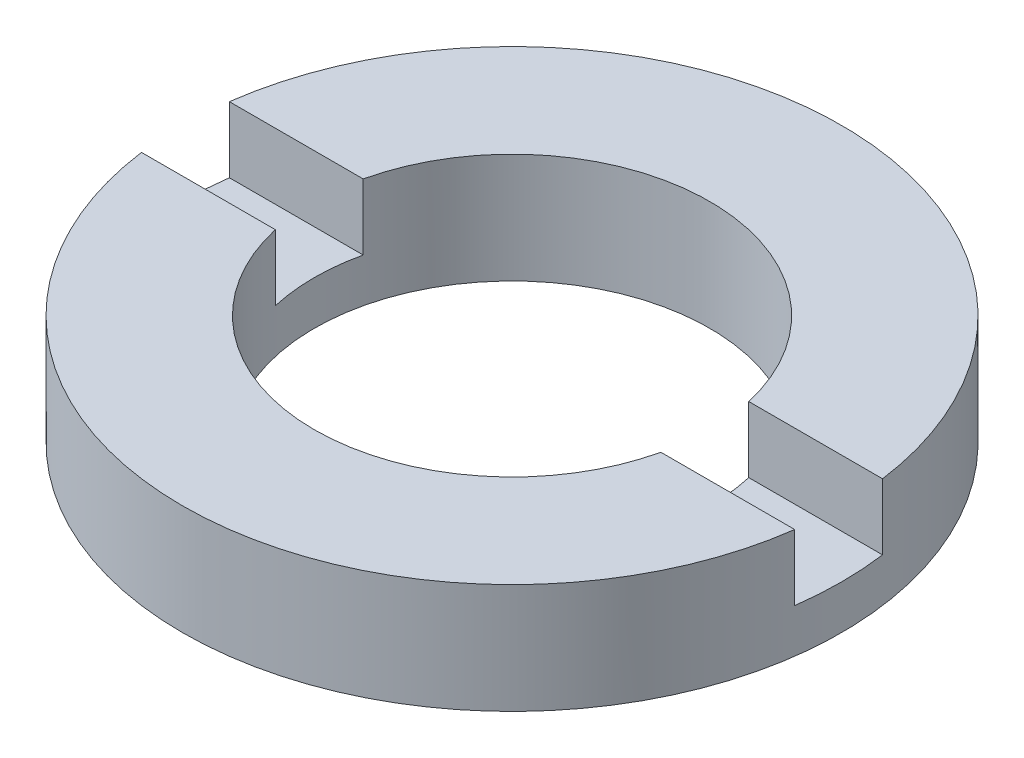
ISO-10303-21;
HEADER;
FILE_DESCRIPTION(('STEP AP214'),'2;1');
FILE_NAME('part.step','',(''),(''),'','','');
FILE_SCHEMA(('AUTOMOTIVE_DESIGN { 1 0 10303 214 1 1 1 1 }'));
ENDSEC;
DATA;
#1=APPLICATION_CONTEXT('core data for automotive mechanical design processes');
#2=APPLICATION_PROTOCOL_DEFINITION('international standard','automotive_design',2000,#1);
#3=PRODUCT_CONTEXT('',#1,'mechanical');
#4=PRODUCT('Part','Part','',(#3));
#5=PRODUCT_RELATED_PRODUCT_CATEGORY('part','',(#4));
#6=PRODUCT_DEFINITION_FORMATION('','',#4);
#7=PRODUCT_DEFINITION_CONTEXT('part definition',#1,'design');
#8=PRODUCT_DEFINITION('design','',#6,#7);
#9=PRODUCT_DEFINITION_SHAPE('','',#8);
#10=(LENGTH_UNIT() NAMED_UNIT(*) SI_UNIT(.MILLI.,.METRE.));
#11=(NAMED_UNIT(*) PLANE_ANGLE_UNIT() SI_UNIT($,.RADIAN.));
#12=(NAMED_UNIT(*) SI_UNIT($,.STERADIAN.) SOLID_ANGLE_UNIT());
#13=UNCERTAINTY_MEASURE_WITH_UNIT(LENGTH_MEASURE(1.E-05),#10,'distance_accuracy_value','');
#14=(GEOMETRIC_REPRESENTATION_CONTEXT(3) GLOBAL_UNCERTAINTY_ASSIGNED_CONTEXT((#13)) GLOBAL_UNIT_ASSIGNED_CONTEXT((#10,
#11,#12)) REPRESENTATION_CONTEXT('',''));
#15=CARTESIAN_POINT('',(0.,0.,0.));
#16=DIRECTION('',(0.,0.,1.));
#17=DIRECTION('',(1.,0.,0.));
#18=AXIS2_PLACEMENT_3D('',#15,#16,#17);
#19=CARTESIAN_POINT('',(4.50000000000001,-1.96424978717943,0.));
#20=DIRECTION('',(0.,-1.,0.));
#21=DIRECTION('',(0.,0.,-1.));
#22=AXIS2_PLACEMENT_3D('',#19,#20,#21);
#23=PLANE('',#22);
#24=CARTESIAN_POINT('',(0.,-1.96424978717943,0.));
#25=DIRECTION('',(0.,1.,0.));
#26=DIRECTION('',(0.,0.,1.));
#27=AXIS2_PLACEMENT_3D('',#24,#25,#26);
#28=CIRCLE('',#27,7.50000000000001);
#29=CARTESIAN_POINT('',(-7.43303437365927,-1.96424978717943,1.));
#30=VERTEX_POINT('',#29);
#31=CARTESIAN_POINT('',(7.43303437365925,-1.96424978717943,1.));
#32=VERTEX_POINT('',#31);
#33=EDGE_CURVE('E125',#30,#32,#28,.T.);
#34=ORIENTED_EDGE('',*,*,#33,.T.);
#35=DIRECTION('',(1.,0.,0.));
#36=VECTOR('',#35,1.);
#37=CARTESIAN_POINT('',(-26.8525402726146,-1.96424978717943,1.));
#38=LINE('',#37,#36);
#39=CARTESIAN_POINT('',(4.38748219369607,-1.96424978717943,1.));
#40=VERTEX_POINT('',#39);
#41=EDGE_CURVE('E118',#40,#32,#38,.T.);
#42=ORIENTED_EDGE('',*,*,#41,.F.);
#43=CARTESIAN_POINT('',(0.,-1.96424978717943,0.));
#44=DIRECTION('',(0.,1.,0.));
#45=DIRECTION('',(0.,0.,1.));
#46=AXIS2_PLACEMENT_3D('',#43,#44,#45);
#47=CIRCLE('',#46,4.50000000000001);
#48=CARTESIAN_POINT('',(-4.38748219369607,-1.96424978717943,1.));
#49=VERTEX_POINT('',#48);
#50=EDGE_CURVE('E132',#49,#40,#47,.T.);
#51=ORIENTED_EDGE('',*,*,#50,.F.);
#52=EDGE_CURVE('E147',#30,#49,#38,.T.);
#53=ORIENTED_EDGE('',*,*,#52,.F.);
#54=EDGE_LOOP('',(#34,#42,#51,#53));
#55=FACE_BOUND('',#54,.T.);
#56=ADVANCED_FACE('F35',(#55),#23,.F.);
#57=CARTESIAN_POINT('',(0.,56.2608426270136,0.));
#58=DIRECTION('',(0.,1.,0.));
#59=DIRECTION('',(0.,0.,1.));
#60=AXIS2_PLACEMENT_3D('',#57,#58,#59);
#61=CYLINDRICAL_SURFACE('',#60,7.50000000000001);
#62=CARTESIAN_POINT('',(0.,-3.46424978717943,0.));
#63=DIRECTION('',(0.,1.,0.));
#64=DIRECTION('',(0.,0.,1.));
#65=AXIS2_PLACEMENT_3D('',#62,#63,#64);
#66=CIRCLE('',#65,7.50000000000001);
#67=CARTESIAN_POINT('',(7.43303437365926,-3.46424978717943,1.));
#68=VERTEX_POINT('',#67);
#69=CARTESIAN_POINT('',(7.43303437365926,-3.46424978717943,-1.));
#70=VERTEX_POINT('',#69);
#71=EDGE_CURVE('E108',#68,#70,#66,.T.);
#72=ORIENTED_EDGE('',*,*,#71,.F.);
#73=DIRECTION('',(0.,1.,0.));
#74=VECTOR('',#73,1.);
#75=CARTESIAN_POINT('',(7.43303437365926,56.2608426270136,1.));
#76=LINE('',#75,#74);
#77=EDGE_CURVE('E160',#68,#32,#76,.T.);
#78=ORIENTED_EDGE('',*,*,#77,.T.);
#79=ORIENTED_EDGE('',*,*,#33,.F.);
#80=DIRECTION('',(0.,1.,0.));
#81=VECTOR('',#80,1.);
#82=CARTESIAN_POINT('',(-7.43303437365926,56.2608426270136,1.));
#83=LINE('',#82,#81);
#84=CARTESIAN_POINT('',(-7.43303437365926,-3.46424978717943,1.));
#85=VERTEX_POINT('',#84);
#86=EDGE_CURVE('E157',#30,#85,#83,.F.);
#87=ORIENTED_EDGE('',*,*,#86,.T.);
#88=CARTESIAN_POINT('',(-7.43303437365926,-3.46424978717943,-1.));
#89=VERTEX_POINT('',#88);
#90=EDGE_CURVE('E154',#89,#85,#66,.T.);
#91=ORIENTED_EDGE('',*,*,#90,.F.);
#92=DIRECTION('',(0.,1.,0.));
#93=VECTOR('',#92,1.);
#94=CARTESIAN_POINT('',(-7.43303437365926,56.2608426270136,-1.));
#95=LINE('',#94,#93);
#96=CARTESIAN_POINT('',(-7.43303437365927,-1.96424978717943,-1.));
#97=VERTEX_POINT('',#96);
#98=EDGE_CURVE('E107',#89,#97,#95,.T.);
#99=ORIENTED_EDGE('',*,*,#98,.T.);
#100=CARTESIAN_POINT('',(7.43303437365925,-1.96424978717943,-1.));
#101=VERTEX_POINT('',#100);
#102=EDGE_CURVE('E115',#101,#97,#28,.T.);
#103=ORIENTED_EDGE('',*,*,#102,.F.);
#104=DIRECTION('',(0.,1.,0.));
#105=VECTOR('',#104,1.);
#106=CARTESIAN_POINT('',(7.43303437365926,56.2608426270136,-1.));
#107=LINE('',#106,#105);
#108=EDGE_CURVE('E99',#101,#70,#107,.F.);
#109=ORIENTED_EDGE('',*,*,#108,.T.);
#110=EDGE_LOOP('',(#72,#78,#79,#87,#91,#99,#103,#109));
#111=FACE_BOUND('',#110,.T.);
#112=CARTESIAN_POINT('',(0.,-4.46424978717943,0.));
#113=DIRECTION('',(0.,1.,0.));
#114=DIRECTION('',(0.,0.,1.));
#115=AXIS2_PLACEMENT_3D('',#112,#113,#114);
#116=CIRCLE('',#115,7.50000000000001);
#117=CARTESIAN_POINT('',(0.,-4.46424978717943,7.50000000000001));
#118=VERTEX_POINT('',#117);
#119=EDGE_CURVE('E163',#118,#118,#116,.T.);
#120=ORIENTED_EDGE('',*,*,#119,.T.);
#121=EDGE_LOOP('',(#120));
#122=FACE_BOUND('',#121,.T.);
#123=ADVANCED_FACE('F37',(#111,#122),#61,.T.);
#124=ORIENTED_EDGE('',*,*,#102,.T.);
#125=DIRECTION('',(-1.,0.,0.));
#126=VECTOR('',#125,1.);
#127=CARTESIAN_POINT('',(-26.8525402726146,-1.96424978717943,-1.));
#128=LINE('',#127,#126);
#129=CARTESIAN_POINT('',(-4.38748219369607,-1.96424978717943,-1.));
#130=VERTEX_POINT('',#129);
#131=EDGE_CURVE('E119',#130,#97,#128,.T.);
#132=ORIENTED_EDGE('',*,*,#131,.F.);
#133=CARTESIAN_POINT('',(4.38748219369607,-1.96424978717943,-1.));
#134=VERTEX_POINT('',#133);
#135=EDGE_CURVE('E117',#134,#130,#47,.T.);
#136=ORIENTED_EDGE('',*,*,#135,.F.);
#137=EDGE_CURVE('E102',#101,#134,#128,.T.);
#138=ORIENTED_EDGE('',*,*,#137,.F.);
#139=EDGE_LOOP('',(#124,#132,#136,#138));
#140=FACE_BOUND('',#139,.T.);
#141=ADVANCED_FACE('F113',(#140),#23,.F.);
#142=CARTESIAN_POINT('',(0.,56.2608426270136,0.));
#143=DIRECTION('',(0.,1.,0.));
#144=DIRECTION('',(0.,0.,1.));
#145=AXIS2_PLACEMENT_3D('',#142,#143,#144);
#146=CYLINDRICAL_SURFACE('',#145,4.50000000000001);
#147=CARTESIAN_POINT('',(0.,-3.46424978717943,0.));
#148=DIRECTION('',(0.,1.,0.));
#149=DIRECTION('',(0.,0.,1.));
#150=AXIS2_PLACEMENT_3D('',#147,#148,#149);
#151=CIRCLE('',#150,4.50000000000001);
#152=CARTESIAN_POINT('',(-4.38748219369607,-3.46424978717943,1.));
#153=VERTEX_POINT('',#152);
#154=CARTESIAN_POINT('',(-4.38748219369607,-3.46424978717943,-1.));
#155=VERTEX_POINT('',#154);
#156=EDGE_CURVE('E129',#153,#155,#151,.F.);
#157=ORIENTED_EDGE('',*,*,#156,.F.);
#158=DIRECTION('',(0.,1.,0.));
#159=VECTOR('',#158,1.);
#160=CARTESIAN_POINT('',(-4.38748219369607,56.2608426270136,1.));
#161=LINE('',#160,#159);
#162=EDGE_CURVE('E11',#153,#49,#161,.T.);
#163=ORIENTED_EDGE('',*,*,#162,.T.);
#164=ORIENTED_EDGE('',*,*,#50,.T.);
#165=DIRECTION('',(0.,1.,0.));
#166=VECTOR('',#165,1.);
#167=CARTESIAN_POINT('',(4.38748219369607,56.2608426270136,1.));
#168=LINE('',#167,#166);
#169=CARTESIAN_POINT('',(4.38748219369607,-3.46424978717943,1.));
#170=VERTEX_POINT('',#169);
#171=EDGE_CURVE('E136',#40,#170,#168,.F.);
#172=ORIENTED_EDGE('',*,*,#171,.T.);
#173=CARTESIAN_POINT('',(4.38748219369607,-3.46424978717943,-1.));
#174=VERTEX_POINT('',#173);
#175=EDGE_CURVE('E124',#174,#170,#151,.F.);
#176=ORIENTED_EDGE('',*,*,#175,.F.);
#177=DIRECTION('',(0.,1.,0.));
#178=VECTOR('',#177,1.);
#179=CARTESIAN_POINT('',(4.38748219369607,56.2608426270136,-1.));
#180=LINE('',#179,#178);
#181=EDGE_CURVE('E127',#174,#134,#180,.T.);
#182=ORIENTED_EDGE('',*,*,#181,.T.);
#183=ORIENTED_EDGE('',*,*,#135,.T.);
#184=DIRECTION('',(0.,1.,0.));
#185=VECTOR('',#184,1.);
#186=CARTESIAN_POINT('',(-4.38748219369607,56.2608426270136,-1.));
#187=LINE('',#186,#185);
#188=EDGE_CURVE('E43',#130,#155,#187,.F.);
#189=ORIENTED_EDGE('',*,*,#188,.T.);
#190=EDGE_LOOP('',(#157,#163,#164,#172,#176,#182,#183,#189));
#191=FACE_BOUND('',#190,.T.);
#192=CARTESIAN_POINT('',(0.,-4.46424978717943,0.));
#193=DIRECTION('',(0.,1.,0.));
#194=DIRECTION('',(0.,0.,1.));
#195=AXIS2_PLACEMENT_3D('',#192,#193,#194);
#196=CIRCLE('',#195,4.50000000000001);
#197=CARTESIAN_POINT('',(0.,-4.46424978717943,4.50000000000001));
#198=VERTEX_POINT('',#197);
#199=EDGE_CURVE('E165',#198,#198,#196,.T.);
#200=ORIENTED_EDGE('',*,*,#199,.F.);
#201=EDGE_LOOP('',(#200));
#202=FACE_BOUND('',#201,.T.);
#203=ADVANCED_FACE('F171',(#191,#202),#146,.F.);
#204=CARTESIAN_POINT('',(4.50000000000001,-4.46424978717943,0.));
#205=DIRECTION('',(0.,1.,0.));
#206=DIRECTION('',(0.,0.,1.));
#207=AXIS2_PLACEMENT_3D('',#204,#205,#206);
#208=PLANE('',#207);
#209=ORIENTED_EDGE('',*,*,#119,.F.);
#210=EDGE_LOOP('',(#209));
#211=FACE_BOUND('',#210,.T.);
#212=ORIENTED_EDGE('',*,*,#199,.T.);
#213=EDGE_LOOP('',(#212));
#214=FACE_BOUND('',#213,.T.);
#215=ADVANCED_FACE('F201',(#211,#214),#208,.F.);
#216=CARTESIAN_POINT('',(0.,-3.46424978717943,0.));
#217=DIRECTION('',(0.,1.,0.));
#218=DIRECTION('',(0.,0.,1.));
#219=AXIS2_PLACEMENT_3D('',#216,#217,#218);
#220=PLANE('',#219);
#221=ORIENTED_EDGE('',*,*,#71,.T.);
#222=DIRECTION('',(-1.,0.,0.));
#223=VECTOR('',#222,1.);
#224=CARTESIAN_POINT('',(-26.8525402726146,-3.46424978717943,-1.));
#225=LINE('',#224,#223);
#226=EDGE_CURVE('E58',#70,#174,#225,.T.);
#227=ORIENTED_EDGE('',*,*,#226,.T.);
#228=ORIENTED_EDGE('',*,*,#175,.T.);
#229=DIRECTION('',(1.,0.,0.));
#230=VECTOR('',#229,1.);
#231=CARTESIAN_POINT('',(-26.8525402726146,-3.46424978717943,1.));
#232=LINE('',#231,#230);
#233=EDGE_CURVE('E149',#170,#68,#232,.T.);
#234=ORIENTED_EDGE('',*,*,#233,.T.);
#235=EDGE_LOOP('',(#221,#227,#228,#234));
#236=FACE_BOUND('',#235,.T.);
#237=ADVANCED_FACE('F175',(#236),#220,.T.);
#238=CARTESIAN_POINT('',(-26.8525402726146,-3.46424978717943,-1.));
#239=DIRECTION('',(0.,0.,-1.));
#240=DIRECTION('',(-1.,0.,0.));
#241=AXIS2_PLACEMENT_3D('',#238,#239,#240);
#242=PLANE('',#241);
#243=ORIENTED_EDGE('',*,*,#137,.T.);
#244=ORIENTED_EDGE('',*,*,#181,.F.);
#245=ORIENTED_EDGE('',*,*,#226,.F.);
#246=ORIENTED_EDGE('',*,*,#108,.F.);
#247=EDGE_LOOP('',(#243,#244,#245,#246));
#248=FACE_BOUND('',#247,.T.);
#249=ADVANCED_FACE('F101',(#248),#242,.F.);
#250=CARTESIAN_POINT('',(-26.8525402726146,-3.46424978717943,1.));
#251=DIRECTION('',(0.,0.,1.));
#252=DIRECTION('',(1.,0.,0.));
#253=AXIS2_PLACEMENT_3D('',#250,#251,#252);
#254=PLANE('',#253);
#255=ORIENTED_EDGE('',*,*,#233,.F.);
#256=ORIENTED_EDGE('',*,*,#171,.F.);
#257=ORIENTED_EDGE('',*,*,#41,.T.);
#258=ORIENTED_EDGE('',*,*,#77,.F.);
#259=EDGE_LOOP('',(#255,#256,#257,#258));
#260=FACE_BOUND('',#259,.T.);
#261=ADVANCED_FACE('F177',(#260),#254,.F.);
#262=ORIENTED_EDGE('',*,*,#52,.T.);
#263=ORIENTED_EDGE('',*,*,#162,.F.);
#264=EDGE_CURVE('E50',#85,#153,#232,.T.);
#265=ORIENTED_EDGE('',*,*,#264,.F.);
#266=ORIENTED_EDGE('',*,*,#86,.F.);
#267=EDGE_LOOP('',(#262,#263,#265,#266));
#268=FACE_BOUND('',#267,.T.);
#269=ADVANCED_FACE('F183',(#268),#254,.F.);
#270=EDGE_CURVE('E144',#155,#89,#225,.T.);
#271=ORIENTED_EDGE('',*,*,#270,.F.);
#272=ORIENTED_EDGE('',*,*,#188,.F.);
#273=ORIENTED_EDGE('',*,*,#131,.T.);
#274=ORIENTED_EDGE('',*,*,#98,.F.);
#275=EDGE_LOOP('',(#271,#272,#273,#274));
#276=FACE_BOUND('',#275,.T.);
#277=ADVANCED_FACE('F146',(#276),#242,.F.);
#278=ORIENTED_EDGE('',*,*,#90,.T.);
#279=ORIENTED_EDGE('',*,*,#264,.T.);
#280=ORIENTED_EDGE('',*,*,#156,.T.);
#281=ORIENTED_EDGE('',*,*,#270,.T.);
#282=EDGE_LOOP('',(#278,#279,#280,#281));
#283=FACE_BOUND('',#282,.T.);
#284=ADVANCED_FACE('F143',(#283),#220,.T.);
#285=CLOSED_SHELL('',(#56,#123,#141,#203,#215,#237,#249,#261,#269,#277,#284));
#286=MANIFOLD_SOLID_BREP('B2',#285);
#287=ADVANCED_BREP_SHAPE_REPRESENTATION('',(#18,#286),#14);
#288=SHAPE_DEFINITION_REPRESENTATION(#9,#287);
ENDSEC;
END-ISO-10303-21;
